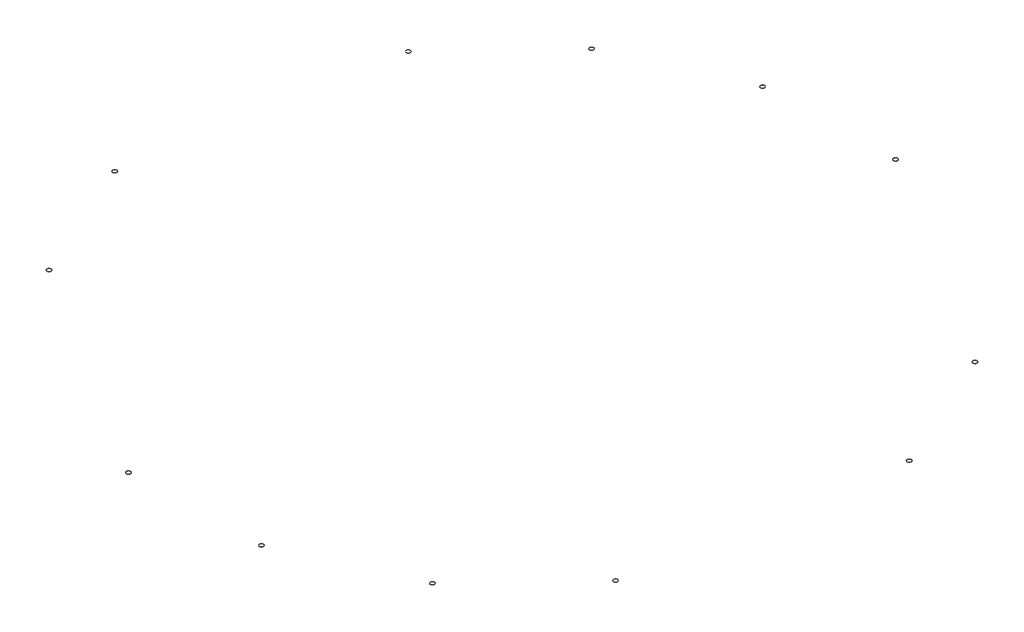
ISO-10303-21;
HEADER;
FILE_DESCRIPTION(('STEP AP214'),'2;1');
FILE_NAME('part.step','',(''),(''),'','','');
FILE_SCHEMA(('AUTOMOTIVE_DESIGN { 1 0 10303 214 1 1 1 1 }'));
ENDSEC;
DATA;
#1=APPLICATION_CONTEXT('core data for automotive mechanical design processes');
#2=APPLICATION_PROTOCOL_DEFINITION('international standard','automotive_design',2000,#1);
#3=PRODUCT_CONTEXT('',#1,'mechanical');
#4=PRODUCT('Part','Part','',(#3));
#5=PRODUCT_RELATED_PRODUCT_CATEGORY('part','',(#4));
#6=PRODUCT_DEFINITION_FORMATION('','',#4);
#7=PRODUCT_DEFINITION_CONTEXT('part definition',#1,'design');
#8=PRODUCT_DEFINITION('design','',#6,#7);
#9=PRODUCT_DEFINITION_SHAPE('','',#8);
#10=(LENGTH_UNIT() NAMED_UNIT(*) SI_UNIT(.MILLI.,.METRE.));
#11=(NAMED_UNIT(*) PLANE_ANGLE_UNIT() SI_UNIT($,.RADIAN.));
#12=(NAMED_UNIT(*) SI_UNIT($,.STERADIAN.) SOLID_ANGLE_UNIT());
#13=UNCERTAINTY_MEASURE_WITH_UNIT(LENGTH_MEASURE(1.E-05),#10,'distance_accuracy_value','');
#14=(GEOMETRIC_REPRESENTATION_CONTEXT(3) GLOBAL_UNCERTAINTY_ASSIGNED_CONTEXT((#13)) GLOBAL_UNIT_ASSIGNED_CONTEXT((#10,
#11,#12)) REPRESENTATION_CONTEXT('',''));
#15=CARTESIAN_POINT('',(0.,0.,0.));
#16=DIRECTION('',(0.,0.,1.));
#17=DIRECTION('',(1.,0.,0.));
#18=AXIS2_PLACEMENT_3D('',#15,#16,#17);
#19=CARTESIAN_POINT('',(-3286.66746070596,3.175,-2073.73273175129));
#20=DIRECTION('',(0.,1.,0.));
#21=DIRECTION('',(0.,0.,1.));
#22=AXIS2_PLACEMENT_3D('',#19,#20,#21);
#23=PLANE('',#22);
#24=CARTESIAN_POINT('',(-3286.66746070596,3.175,-2073.73273175129));
#25=DIRECTION('',(0.,1.,0.));
#26=DIRECTION('',(0.,0.,1.));
#27=AXIS2_PLACEMENT_3D('',#24,#25,#26);
#28=CIRCLE('',#27,25.3999999999998);
#29=CARTESIAN_POINT('',(-3286.66746070596,3.175,-2048.33273175129));
#30=VERTEX_POINT('',#29);
#31=EDGE_CURVE('E11',#30,#30,#28,.T.);
#32=ORIENTED_EDGE('',*,*,#31,.T.);
#33=EDGE_LOOP('',(#32));
#34=FACE_BOUND('',#33,.T.);
#35=CARTESIAN_POINT('',(-3286.66746070596,3.175,-2073.73273175129));
#36=DIRECTION('',(0.,1.,0.));
#37=DIRECTION('',(0.,0.,1.));
#38=AXIS2_PLACEMENT_3D('',#35,#36,#37);
#39=CIRCLE('',#38,22.2250000000001);
#40=CARTESIAN_POINT('',(-3286.66746070596,3.175,-2051.50773175129));
#41=VERTEX_POINT('',#40);
#42=EDGE_CURVE('E50',#41,#41,#39,.T.);
#43=ORIENTED_EDGE('',*,*,#42,.F.);
#44=EDGE_LOOP('',(#43));
#45=FACE_BOUND('',#44,.T.);
#46=ADVANCED_FACE('F39',(#34,#45),#23,.T.);
#47=CARTESIAN_POINT('',(-3286.66746070596,0.,-2073.73273175129));
#48=DIRECTION('',(0.,1.,0.));
#49=DIRECTION('',(0.,0.,1.));
#50=AXIS2_PLACEMENT_3D('',#47,#48,#49);
#51=PLANE('',#50);
#52=CARTESIAN_POINT('',(-3286.66746070596,0.,-2073.73273175129));
#53=DIRECTION('',(0.,1.,0.));
#54=DIRECTION('',(0.,0.,1.));
#55=AXIS2_PLACEMENT_3D('',#52,#53,#54);
#56=CIRCLE('',#55,25.3999999999998);
#57=CARTESIAN_POINT('',(-3286.66746070596,0.,-2048.33273175129));
#58=VERTEX_POINT('',#57);
#59=EDGE_CURVE('E43',#58,#58,#56,.T.);
#60=ORIENTED_EDGE('',*,*,#59,.F.);
#61=EDGE_LOOP('',(#60));
#62=FACE_BOUND('',#61,.T.);
#63=CARTESIAN_POINT('',(-3286.66746070596,0.,-2073.73273175129));
#64=DIRECTION('',(0.,1.,0.));
#65=DIRECTION('',(0.,0.,1.));
#66=AXIS2_PLACEMENT_3D('',#63,#64,#65);
#67=CIRCLE('',#66,22.2250000000001);
#68=CARTESIAN_POINT('',(-3286.66746070596,0.,-2051.50773175129));
#69=VERTEX_POINT('',#68);
#70=EDGE_CURVE('E52',#69,#69,#67,.T.);
#71=ORIENTED_EDGE('',*,*,#70,.T.);
#72=EDGE_LOOP('',(#71));
#73=FACE_BOUND('',#72,.T.);
#74=ADVANCED_FACE('F62',(#62,#73),#51,.F.);
#75=CARTESIAN_POINT('',(-3286.66746070596,3.175,-2073.73273175129));
#76=DIRECTION('',(0.,-1.,0.));
#77=DIRECTION('',(0.,0.,-1.));
#78=AXIS2_PLACEMENT_3D('',#75,#76,#77);
#79=CYLINDRICAL_SURFACE('',#78,25.3999999999998);
#80=ORIENTED_EDGE('',*,*,#31,.F.);
#81=EDGE_LOOP('',(#80));
#82=FACE_BOUND('',#81,.T.);
#83=ORIENTED_EDGE('',*,*,#59,.T.);
#84=EDGE_LOOP('',(#83));
#85=FACE_BOUND('',#84,.T.);
#86=ADVANCED_FACE('F41',(#82,#85),#79,.T.);
#87=CARTESIAN_POINT('',(-3286.66746070596,3.175,-2073.73273175129));
#88=DIRECTION('',(0.,-1.,0.));
#89=DIRECTION('',(0.,0.,-1.));
#90=AXIS2_PLACEMENT_3D('',#87,#88,#89);
#91=CYLINDRICAL_SURFACE('',#90,22.2250000000001);
#92=ORIENTED_EDGE('',*,*,#42,.T.);
#93=EDGE_LOOP('',(#92));
#94=FACE_BOUND('',#93,.T.);
#95=ORIENTED_EDGE('',*,*,#70,.F.);
#96=EDGE_LOOP('',(#95));
#97=FACE_BOUND('',#96,.T.);
#98=ADVANCED_FACE('F58',(#94,#97),#91,.F.);
#99=CLOSED_SHELL('',(#46,#74,#86,#98));
#100=MANIFOLD_SOLID_BREP('B2',#99);
#101=CARTESIAN_POINT('',(-2242.90163752268,3.175,-3173.63241166933));
#102=DIRECTION('',(0.,1.,0.));
#103=DIRECTION('',(0.,0.,1.));
#104=AXIS2_PLACEMENT_3D('',#101,#102,#103);
#105=PLANE('',#104);
#106=CARTESIAN_POINT('',(-2242.90163752268,3.175,-3173.63241166933));
#107=DIRECTION('',(0.,1.,0.));
#108=DIRECTION('',(0.,0.,1.));
#109=AXIS2_PLACEMENT_3D('',#106,#107,#108);
#110=CIRCLE('',#109,25.3999999999998);
#111=CARTESIAN_POINT('',(-2242.90163752268,3.175,-3148.23241166933));
#112=VERTEX_POINT('',#111);
#113=EDGE_CURVE('E38',#112,#112,#110,.T.);
#114=ORIENTED_EDGE('',*,*,#113,.T.);
#115=EDGE_LOOP('',(#114));
#116=FACE_BOUND('',#115,.T.);
#117=CARTESIAN_POINT('',(-2242.90163752268,3.175,-3173.63241166933));
#118=DIRECTION('',(0.,1.,0.));
#119=DIRECTION('',(0.,0.,1.));
#120=AXIS2_PLACEMENT_3D('',#117,#118,#119);
#121=CIRCLE('',#120,22.2250000000001);
#122=CARTESIAN_POINT('',(-2242.90163752268,3.175,-3151.40741166933));
#123=VERTEX_POINT('',#122);
#124=EDGE_CURVE('E119',#123,#123,#121,.T.);
#125=ORIENTED_EDGE('',*,*,#124,.F.);
#126=EDGE_LOOP('',(#125));
#127=FACE_BOUND('',#126,.T.);
#128=ADVANCED_FACE('F108',(#116,#127),#105,.T.);
#129=CARTESIAN_POINT('',(-2242.90163752268,0.,-3173.63241166933));
#130=DIRECTION('',(0.,1.,0.));
#131=DIRECTION('',(0.,0.,1.));
#132=AXIS2_PLACEMENT_3D('',#129,#130,#131);
#133=PLANE('',#132);
#134=CARTESIAN_POINT('',(-2242.90163752268,0.,-3173.63241166933));
#135=DIRECTION('',(0.,1.,0.));
#136=DIRECTION('',(0.,0.,1.));
#137=AXIS2_PLACEMENT_3D('',#134,#135,#136);
#138=CIRCLE('',#137,25.3999999999998);
#139=CARTESIAN_POINT('',(-2242.90163752268,0.,-3148.23241166933));
#140=VERTEX_POINT('',#139);
#141=EDGE_CURVE('E112',#140,#140,#138,.T.);
#142=ORIENTED_EDGE('',*,*,#141,.F.);
#143=EDGE_LOOP('',(#142));
#144=FACE_BOUND('',#143,.T.);
#145=CARTESIAN_POINT('',(-2242.90163752268,0.,-3173.63241166933));
#146=DIRECTION('',(0.,1.,0.));
#147=DIRECTION('',(0.,0.,1.));
#148=AXIS2_PLACEMENT_3D('',#145,#146,#147);
#149=CIRCLE('',#148,22.2250000000001);
#150=CARTESIAN_POINT('',(-2242.90163752268,0.,-3151.40741166933));
#151=VERTEX_POINT('',#150);
#152=EDGE_CURVE('E121',#151,#151,#149,.T.);
#153=ORIENTED_EDGE('',*,*,#152,.T.);
#154=EDGE_LOOP('',(#153));
#155=FACE_BOUND('',#154,.T.);
#156=ADVANCED_FACE('F131',(#144,#155),#133,.F.);
#157=CARTESIAN_POINT('',(-2242.90163752268,3.175,-3173.63241166933));
#158=DIRECTION('',(0.,-1.,0.));
#159=DIRECTION('',(0.,0.,-1.));
#160=AXIS2_PLACEMENT_3D('',#157,#158,#159);
#161=CYLINDRICAL_SURFACE('',#160,25.3999999999998);
#162=ORIENTED_EDGE('',*,*,#113,.F.);
#163=EDGE_LOOP('',(#162));
#164=FACE_BOUND('',#163,.T.);
#165=ORIENTED_EDGE('',*,*,#141,.T.);
#166=EDGE_LOOP('',(#165));
#167=FACE_BOUND('',#166,.T.);
#168=ADVANCED_FACE('F110',(#164,#167),#161,.T.);
#169=CARTESIAN_POINT('',(-2242.90163752268,3.175,-3173.63241166933));
#170=DIRECTION('',(0.,-1.,0.));
#171=DIRECTION('',(0.,0.,-1.));
#172=AXIS2_PLACEMENT_3D('',#169,#170,#171);
#173=CYLINDRICAL_SURFACE('',#172,22.2250000000001);
#174=ORIENTED_EDGE('',*,*,#124,.T.);
#175=EDGE_LOOP('',(#174));
#176=FACE_BOUND('',#175,.T.);
#177=ORIENTED_EDGE('',*,*,#152,.F.);
#178=EDGE_LOOP('',(#177));
#179=FACE_BOUND('',#178,.T.);
#180=ADVANCED_FACE('F127',(#176,#179),#173,.F.);
#181=CLOSED_SHELL('',(#128,#156,#168,#180));
#182=MANIFOLD_SOLID_BREP('B6',#181);
#183=CARTESIAN_POINT('',(-857.674371980562,3.175,-3790.37532596018));
#184=DIRECTION('',(0.,1.,0.));
#185=DIRECTION('',(0.,0.,1.));
#186=AXIS2_PLACEMENT_3D('',#183,#184,#185);
#187=PLANE('',#186);
#188=CARTESIAN_POINT('',(-857.674371980562,3.175,-3790.37532596018));
#189=DIRECTION('',(0.,1.,0.));
#190=DIRECTION('',(0.,0.,1.));
#191=AXIS2_PLACEMENT_3D('',#188,#189,#190);
#192=CIRCLE('',#191,25.4);
#193=CARTESIAN_POINT('',(-857.674371980562,3.175,-3764.97532596018));
#194=VERTEX_POINT('',#193);
#195=EDGE_CURVE('E107',#194,#194,#192,.T.);
#196=ORIENTED_EDGE('',*,*,#195,.T.);
#197=EDGE_LOOP('',(#196));
#198=FACE_BOUND('',#197,.T.);
#199=CARTESIAN_POINT('',(-857.674371980562,3.175,-3790.37532596018));
#200=DIRECTION('',(0.,1.,0.));
#201=DIRECTION('',(0.,0.,1.));
#202=AXIS2_PLACEMENT_3D('',#199,#200,#201);
#203=CIRCLE('',#202,22.225);
#204=CARTESIAN_POINT('',(-857.674371980562,3.175,-3768.15032596018));
#205=VERTEX_POINT('',#204);
#206=EDGE_CURVE('E188',#205,#205,#203,.T.);
#207=ORIENTED_EDGE('',*,*,#206,.F.);
#208=EDGE_LOOP('',(#207));
#209=FACE_BOUND('',#208,.T.);
#210=ADVANCED_FACE('F177',(#198,#209),#187,.T.);
#211=CARTESIAN_POINT('',(-857.674371980562,0.,-3790.37532596018));
#212=DIRECTION('',(0.,1.,0.));
#213=DIRECTION('',(0.,0.,1.));
#214=AXIS2_PLACEMENT_3D('',#211,#212,#213);
#215=PLANE('',#214);
#216=CARTESIAN_POINT('',(-857.674371980562,0.,-3790.37532596018));
#217=DIRECTION('',(0.,1.,0.));
#218=DIRECTION('',(0.,0.,1.));
#219=AXIS2_PLACEMENT_3D('',#216,#217,#218);
#220=CIRCLE('',#219,25.4);
#221=CARTESIAN_POINT('',(-857.674371980562,0.,-3764.97532596018));
#222=VERTEX_POINT('',#221);
#223=EDGE_CURVE('E181',#222,#222,#220,.T.);
#224=ORIENTED_EDGE('',*,*,#223,.F.);
#225=EDGE_LOOP('',(#224));
#226=FACE_BOUND('',#225,.T.);
#227=CARTESIAN_POINT('',(-857.674371980562,0.,-3790.37532596018));
#228=DIRECTION('',(0.,1.,0.));
#229=DIRECTION('',(0.,0.,1.));
#230=AXIS2_PLACEMENT_3D('',#227,#228,#229);
#231=CIRCLE('',#230,22.225);
#232=CARTESIAN_POINT('',(-857.674371980562,0.,-3768.15032596018));
#233=VERTEX_POINT('',#232);
#234=EDGE_CURVE('E190',#233,#233,#231,.T.);
#235=ORIENTED_EDGE('',*,*,#234,.T.);
#236=EDGE_LOOP('',(#235));
#237=FACE_BOUND('',#236,.T.);
#238=ADVANCED_FACE('F200',(#226,#237),#215,.F.);
#239=CARTESIAN_POINT('',(-857.674371980562,3.175,-3790.37532596018));
#240=DIRECTION('',(0.,-1.,0.));
#241=DIRECTION('',(0.,0.,-1.));
#242=AXIS2_PLACEMENT_3D('',#239,#240,#241);
#243=CYLINDRICAL_SURFACE('',#242,25.4);
#244=ORIENTED_EDGE('',*,*,#195,.F.);
#245=EDGE_LOOP('',(#244));
#246=FACE_BOUND('',#245,.T.);
#247=ORIENTED_EDGE('',*,*,#223,.T.);
#248=EDGE_LOOP('',(#247));
#249=FACE_BOUND('',#248,.T.);
#250=ADVANCED_FACE('F179',(#246,#249),#243,.T.);
#251=CARTESIAN_POINT('',(-857.674371980562,3.175,-3790.37532596018));
#252=DIRECTION('',(0.,-1.,0.));
#253=DIRECTION('',(0.,0.,-1.));
#254=AXIS2_PLACEMENT_3D('',#251,#252,#253);
#255=CYLINDRICAL_SURFACE('',#254,22.225);
#256=ORIENTED_EDGE('',*,*,#206,.T.);
#257=EDGE_LOOP('',(#256));
#258=FACE_BOUND('',#257,.T.);
#259=ORIENTED_EDGE('',*,*,#234,.F.);
#260=EDGE_LOOP('',(#259));
#261=FACE_BOUND('',#260,.T.);
#262=ADVANCED_FACE('F196',(#258,#261),#255,.F.);
#263=CLOSED_SHELL('',(#210,#238,#250,#262));
#264=MANIFOLD_SOLID_BREP('B33',#263);
#265=CARTESIAN_POINT('',(658.126041858051,3.175,-3830.06795671151));
#266=DIRECTION('',(0.,1.,0.));
#267=DIRECTION('',(0.,0.,1.));
#268=AXIS2_PLACEMENT_3D('',#265,#266,#267);
#269=PLANE('',#268);
#270=CARTESIAN_POINT('',(658.126041858051,3.175,-3830.06795671151));
#271=DIRECTION('',(0.,1.,0.));
#272=DIRECTION('',(0.,0.,1.));
#273=AXIS2_PLACEMENT_3D('',#270,#271,#272);
#274=CIRCLE('',#273,25.4);
#275=CARTESIAN_POINT('',(658.126041858051,3.175,-3804.66795671151));
#276=VERTEX_POINT('',#275);
#277=EDGE_CURVE('E176',#276,#276,#274,.T.);
#278=ORIENTED_EDGE('',*,*,#277,.T.);
#279=EDGE_LOOP('',(#278));
#280=FACE_BOUND('',#279,.T.);
#281=CARTESIAN_POINT('',(658.126041858051,3.175,-3830.06795671151));
#282=DIRECTION('',(0.,1.,0.));
#283=DIRECTION('',(0.,0.,1.));
#284=AXIS2_PLACEMENT_3D('',#281,#282,#283);
#285=CIRCLE('',#284,22.225);
#286=CARTESIAN_POINT('',(658.126041858051,3.175,-3807.84295671151));
#287=VERTEX_POINT('',#286);
#288=EDGE_CURVE('E257',#287,#287,#285,.T.);
#289=ORIENTED_EDGE('',*,*,#288,.F.);
#290=EDGE_LOOP('',(#289));
#291=FACE_BOUND('',#290,.T.);
#292=ADVANCED_FACE('F246',(#280,#291),#269,.T.);
#293=CARTESIAN_POINT('',(658.126041858051,0.,-3830.06795671151));
#294=DIRECTION('',(0.,1.,0.));
#295=DIRECTION('',(0.,0.,1.));
#296=AXIS2_PLACEMENT_3D('',#293,#294,#295);
#297=PLANE('',#296);
#298=CARTESIAN_POINT('',(658.126041858051,0.,-3830.06795671151));
#299=DIRECTION('',(0.,1.,0.));
#300=DIRECTION('',(0.,0.,1.));
#301=AXIS2_PLACEMENT_3D('',#298,#299,#300);
#302=CIRCLE('',#301,25.4);
#303=CARTESIAN_POINT('',(658.126041858051,0.,-3804.66795671151));
#304=VERTEX_POINT('',#303);
#305=EDGE_CURVE('E250',#304,#304,#302,.T.);
#306=ORIENTED_EDGE('',*,*,#305,.F.);
#307=EDGE_LOOP('',(#306));
#308=FACE_BOUND('',#307,.T.);
#309=CARTESIAN_POINT('',(658.126041858051,0.,-3830.06795671151));
#310=DIRECTION('',(0.,1.,0.));
#311=DIRECTION('',(0.,0.,1.));
#312=AXIS2_PLACEMENT_3D('',#309,#310,#311);
#313=CIRCLE('',#312,22.225);
#314=CARTESIAN_POINT('',(658.126041858051,0.,-3807.84295671151));
#315=VERTEX_POINT('',#314);
#316=EDGE_CURVE('E259',#315,#315,#313,.T.);
#317=ORIENTED_EDGE('',*,*,#316,.T.);
#318=EDGE_LOOP('',(#317));
#319=FACE_BOUND('',#318,.T.);
#320=ADVANCED_FACE('F269',(#308,#319),#297,.F.);
#321=CARTESIAN_POINT('',(658.126041858051,3.175,-3830.06795671151));
#322=DIRECTION('',(0.,-1.,0.));
#323=DIRECTION('',(0.,0.,-1.));
#324=AXIS2_PLACEMENT_3D('',#321,#322,#323);
#325=CYLINDRICAL_SURFACE('',#324,25.4);
#326=ORIENTED_EDGE('',*,*,#277,.F.);
#327=EDGE_LOOP('',(#326));
#328=FACE_BOUND('',#327,.T.);
#329=ORIENTED_EDGE('',*,*,#305,.T.);
#330=EDGE_LOOP('',(#329));
#331=FACE_BOUND('',#330,.T.);
#332=ADVANCED_FACE('F248',(#328,#331),#325,.T.);
#333=CARTESIAN_POINT('',(658.126041858051,3.175,-3830.06795671151));
#334=DIRECTION('',(0.,-1.,0.));
#335=DIRECTION('',(0.,0.,-1.));
#336=AXIS2_PLACEMENT_3D('',#333,#334,#335);
#337=CYLINDRICAL_SURFACE('',#336,22.225);
#338=ORIENTED_EDGE('',*,*,#288,.T.);
#339=EDGE_LOOP('',(#338));
#340=FACE_BOUND('',#339,.T.);
#341=ORIENTED_EDGE('',*,*,#316,.F.);
#342=EDGE_LOOP('',(#341));
#343=FACE_BOUND('',#342,.T.);
#344=ADVANCED_FACE('F265',(#340,#343),#337,.F.);
#345=CLOSED_SHELL('',(#292,#320,#332,#344));
#346=MANIFOLD_SOLID_BREP('B102',#345);
#347=CARTESIAN_POINT('',(3173.63241166929,3.175,-2242.90163752274));
#348=DIRECTION('',(0.,1.,0.));
#349=DIRECTION('',(0.,0.,1.));
#350=AXIS2_PLACEMENT_3D('',#347,#348,#349);
#351=PLANE('',#350);
#352=CARTESIAN_POINT('',(3173.63241166929,3.175,-2242.90163752274));
#353=DIRECTION('',(0.,1.,0.));
#354=DIRECTION('',(0.,0.,1.));
#355=AXIS2_PLACEMENT_3D('',#352,#353,#354);
#356=CIRCLE('',#355,25.3999999999998);
#357=CARTESIAN_POINT('',(3173.63241166929,3.175,-2217.50163752274));
#358=VERTEX_POINT('',#357);
#359=EDGE_CURVE('E245',#358,#358,#356,.T.);
#360=ORIENTED_EDGE('',*,*,#359,.T.);
#361=EDGE_LOOP('',(#360));
#362=FACE_BOUND('',#361,.T.);
#363=CARTESIAN_POINT('',(3173.63241166929,3.175,-2242.90163752274));
#364=DIRECTION('',(0.,1.,0.));
#365=DIRECTION('',(0.,0.,1.));
#366=AXIS2_PLACEMENT_3D('',#363,#364,#365);
#367=CIRCLE('',#366,22.2250000000001);
#368=CARTESIAN_POINT('',(3173.63241166929,3.175,-2220.67663752274));
#369=VERTEX_POINT('',#368);
#370=EDGE_CURVE('E326',#369,#369,#367,.T.);
#371=ORIENTED_EDGE('',*,*,#370,.F.);
#372=EDGE_LOOP('',(#371));
#373=FACE_BOUND('',#372,.T.);
#374=ADVANCED_FACE('F315',(#362,#373),#351,.T.);
#375=CARTESIAN_POINT('',(3173.63241166929,0.,-2242.90163752274));
#376=DIRECTION('',(0.,1.,0.));
#377=DIRECTION('',(0.,0.,1.));
#378=AXIS2_PLACEMENT_3D('',#375,#376,#377);
#379=PLANE('',#378);
#380=CARTESIAN_POINT('',(3173.63241166929,0.,-2242.90163752274));
#381=DIRECTION('',(0.,1.,0.));
#382=DIRECTION('',(0.,0.,1.));
#383=AXIS2_PLACEMENT_3D('',#380,#381,#382);
#384=CIRCLE('',#383,25.3999999999998);
#385=CARTESIAN_POINT('',(3173.63241166929,0.,-2217.50163752274));
#386=VERTEX_POINT('',#385);
#387=EDGE_CURVE('E319',#386,#386,#384,.T.);
#388=ORIENTED_EDGE('',*,*,#387,.F.);
#389=EDGE_LOOP('',(#388));
#390=FACE_BOUND('',#389,.T.);
#391=CARTESIAN_POINT('',(3173.63241166929,0.,-2242.90163752274));
#392=DIRECTION('',(0.,1.,0.));
#393=DIRECTION('',(0.,0.,1.));
#394=AXIS2_PLACEMENT_3D('',#391,#392,#393);
#395=CIRCLE('',#394,22.2250000000001);
#396=CARTESIAN_POINT('',(3173.63241166929,0.,-2220.67663752274));
#397=VERTEX_POINT('',#396);
#398=EDGE_CURVE('E328',#397,#397,#395,.T.);
#399=ORIENTED_EDGE('',*,*,#398,.T.);
#400=EDGE_LOOP('',(#399));
#401=FACE_BOUND('',#400,.T.);
#402=ADVANCED_FACE('F338',(#390,#401),#379,.F.);
#403=CARTESIAN_POINT('',(3173.63241166929,3.175,-2242.90163752274));
#404=DIRECTION('',(0.,-1.,0.));
#405=DIRECTION('',(0.,0.,-1.));
#406=AXIS2_PLACEMENT_3D('',#403,#404,#405);
#407=CYLINDRICAL_SURFACE('',#406,25.3999999999998);
#408=ORIENTED_EDGE('',*,*,#359,.F.);
#409=EDGE_LOOP('',(#408));
#410=FACE_BOUND('',#409,.T.);
#411=ORIENTED_EDGE('',*,*,#387,.T.);
#412=EDGE_LOOP('',(#411));
#413=FACE_BOUND('',#412,.T.);
#414=ADVANCED_FACE('F317',(#410,#413),#407,.T.);
#415=CARTESIAN_POINT('',(3173.63241166929,3.175,-2242.90163752274));
#416=DIRECTION('',(0.,-1.,0.));
#417=DIRECTION('',(0.,0.,-1.));
#418=AXIS2_PLACEMENT_3D('',#415,#416,#417);
#419=CYLINDRICAL_SURFACE('',#418,22.2250000000001);
#420=ORIENTED_EDGE('',*,*,#370,.T.);
#421=EDGE_LOOP('',(#420));
#422=FACE_BOUND('',#421,.T.);
#423=ORIENTED_EDGE('',*,*,#398,.F.);
#424=EDGE_LOOP('',(#423));
#425=FACE_BOUND('',#424,.T.);
#426=ADVANCED_FACE('F334',(#422,#425),#419,.F.);
#427=CLOSED_SHELL('',(#374,#402,#414,#426));
#428=MANIFOLD_SOLID_BREP('B171',#427);
#429=CARTESIAN_POINT('',(3790.37532596017,3.175,-857.674371980631));
#430=DIRECTION('',(0.,1.,0.));
#431=DIRECTION('',(0.,0.,1.));
#432=AXIS2_PLACEMENT_3D('',#429,#430,#431);
#433=PLANE('',#432);
#434=CARTESIAN_POINT('',(3790.37532596017,3.175,-857.674371980631));
#435=DIRECTION('',(0.,1.,0.));
#436=DIRECTION('',(0.,0.,1.));
#437=AXIS2_PLACEMENT_3D('',#434,#435,#436);
#438=CIRCLE('',#437,25.3999999999998);
#439=CARTESIAN_POINT('',(3790.37532596017,3.175,-832.274371980631));
#440=VERTEX_POINT('',#439);
#441=EDGE_CURVE('E314',#440,#440,#438,.T.);
#442=ORIENTED_EDGE('',*,*,#441,.T.);
#443=EDGE_LOOP('',(#442));
#444=FACE_BOUND('',#443,.T.);
#445=CARTESIAN_POINT('',(3790.37532596017,3.175,-857.674371980631));
#446=DIRECTION('',(0.,1.,0.));
#447=DIRECTION('',(0.,0.,1.));
#448=AXIS2_PLACEMENT_3D('',#445,#446,#447);
#449=CIRCLE('',#448,22.2250000000001);
#450=CARTESIAN_POINT('',(3790.37532596017,3.175,-835.449371980631));
#451=VERTEX_POINT('',#450);
#452=EDGE_CURVE('E395',#451,#451,#449,.T.);
#453=ORIENTED_EDGE('',*,*,#452,.F.);
#454=EDGE_LOOP('',(#453));
#455=FACE_BOUND('',#454,.T.);
#456=ADVANCED_FACE('F384',(#444,#455),#433,.T.);
#457=CARTESIAN_POINT('',(3790.37532596017,0.,-857.674371980631));
#458=DIRECTION('',(0.,1.,0.));
#459=DIRECTION('',(0.,0.,1.));
#460=AXIS2_PLACEMENT_3D('',#457,#458,#459);
#461=PLANE('',#460);
#462=CARTESIAN_POINT('',(3790.37532596017,0.,-857.674371980631));
#463=DIRECTION('',(0.,1.,0.));
#464=DIRECTION('',(0.,0.,1.));
#465=AXIS2_PLACEMENT_3D('',#462,#463,#464);
#466=CIRCLE('',#465,25.3999999999998);
#467=CARTESIAN_POINT('',(3790.37532596017,0.,-832.274371980631));
#468=VERTEX_POINT('',#467);
#469=EDGE_CURVE('E388',#468,#468,#466,.T.);
#470=ORIENTED_EDGE('',*,*,#469,.F.);
#471=EDGE_LOOP('',(#470));
#472=FACE_BOUND('',#471,.T.);
#473=CARTESIAN_POINT('',(3790.37532596017,0.,-857.674371980631));
#474=DIRECTION('',(0.,1.,0.));
#475=DIRECTION('',(0.,0.,1.));
#476=AXIS2_PLACEMENT_3D('',#473,#474,#475);
#477=CIRCLE('',#476,22.2250000000001);
#478=CARTESIAN_POINT('',(3790.37532596017,0.,-835.449371980631));
#479=VERTEX_POINT('',#478);
#480=EDGE_CURVE('E397',#479,#479,#477,.T.);
#481=ORIENTED_EDGE('',*,*,#480,.T.);
#482=EDGE_LOOP('',(#481));
#483=FACE_BOUND('',#482,.T.);
#484=ADVANCED_FACE('F407',(#472,#483),#461,.F.);
#485=CARTESIAN_POINT('',(3790.37532596017,3.175,-857.674371980631));
#486=DIRECTION('',(0.,-1.,0.));
#487=DIRECTION('',(0.,0.,-1.));
#488=AXIS2_PLACEMENT_3D('',#485,#486,#487);
#489=CYLINDRICAL_SURFACE('',#488,25.3999999999998);
#490=ORIENTED_EDGE('',*,*,#441,.F.);
#491=EDGE_LOOP('',(#490));
#492=FACE_BOUND('',#491,.T.);
#493=ORIENTED_EDGE('',*,*,#469,.T.);
#494=EDGE_LOOP('',(#493));
#495=FACE_BOUND('',#494,.T.);
#496=ADVANCED_FACE('F386',(#492,#495),#489,.T.);
#497=CARTESIAN_POINT('',(3790.37532596017,3.175,-857.674371980631));
#498=DIRECTION('',(0.,-1.,0.));
#499=DIRECTION('',(0.,0.,-1.));
#500=AXIS2_PLACEMENT_3D('',#497,#498,#499);
#501=CYLINDRICAL_SURFACE('',#500,22.2250000000001);
#502=ORIENTED_EDGE('',*,*,#452,.T.);
#503=EDGE_LOOP('',(#502));
#504=FACE_BOUND('',#503,.T.);
#505=ORIENTED_EDGE('',*,*,#480,.F.);
#506=EDGE_LOOP('',(#505));
#507=FACE_BOUND('',#506,.T.);
#508=ADVANCED_FACE('F403',(#504,#507),#501,.F.);
#509=CLOSED_SHELL('',(#456,#484,#496,#508));
#510=MANIFOLD_SOLID_BREP('B240',#509);
#511=CARTESIAN_POINT('',(3286.66746070594,3.175,2073.73273175131));
#512=DIRECTION('',(0.,1.,0.));
#513=DIRECTION('',(0.,0.,1.));
#514=AXIS2_PLACEMENT_3D('',#511,#512,#513);
#515=PLANE('',#514);
#516=CARTESIAN_POINT('',(3286.66746070594,3.175,2073.73273175131));
#517=DIRECTION('',(0.,1.,0.));
#518=DIRECTION('',(0.,0.,1.));
#519=AXIS2_PLACEMENT_3D('',#516,#517,#518);
#520=CIRCLE('',#519,25.3999999999998);
#521=CARTESIAN_POINT('',(3286.66746070594,3.175,2099.13273175131));
#522=VERTEX_POINT('',#521);
#523=EDGE_CURVE('E383',#522,#522,#520,.T.);
#524=ORIENTED_EDGE('',*,*,#523,.T.);
#525=EDGE_LOOP('',(#524));
#526=FACE_BOUND('',#525,.T.);
#527=CARTESIAN_POINT('',(3286.66746070594,3.175,2073.73273175131));
#528=DIRECTION('',(0.,1.,0.));
#529=DIRECTION('',(0.,0.,1.));
#530=AXIS2_PLACEMENT_3D('',#527,#528,#529);
#531=CIRCLE('',#530,22.2250000000001);
#532=CARTESIAN_POINT('',(3286.66746070594,3.175,2095.95773175131));
#533=VERTEX_POINT('',#532);
#534=EDGE_CURVE('E464',#533,#533,#531,.T.);
#535=ORIENTED_EDGE('',*,*,#534,.F.);
#536=EDGE_LOOP('',(#535));
#537=FACE_BOUND('',#536,.T.);
#538=ADVANCED_FACE('F453',(#526,#537),#515,.T.);
#539=CARTESIAN_POINT('',(3286.66746070594,0.,2073.73273175131));
#540=DIRECTION('',(0.,1.,0.));
#541=DIRECTION('',(0.,0.,1.));
#542=AXIS2_PLACEMENT_3D('',#539,#540,#541);
#543=PLANE('',#542);
#544=CARTESIAN_POINT('',(3286.66746070594,0.,2073.73273175131));
#545=DIRECTION('',(0.,1.,0.));
#546=DIRECTION('',(0.,0.,1.));
#547=AXIS2_PLACEMENT_3D('',#544,#545,#546);
#548=CIRCLE('',#547,25.3999999999998);
#549=CARTESIAN_POINT('',(3286.66746070594,0.,2099.13273175131));
#550=VERTEX_POINT('',#549);
#551=EDGE_CURVE('E457',#550,#550,#548,.T.);
#552=ORIENTED_EDGE('',*,*,#551,.F.);
#553=EDGE_LOOP('',(#552));
#554=FACE_BOUND('',#553,.T.);
#555=CARTESIAN_POINT('',(3286.66746070594,0.,2073.73273175131));
#556=DIRECTION('',(0.,1.,0.));
#557=DIRECTION('',(0.,0.,1.));
#558=AXIS2_PLACEMENT_3D('',#555,#556,#557);
#559=CIRCLE('',#558,22.2250000000001);
#560=CARTESIAN_POINT('',(3286.66746070594,0.,2095.95773175131));
#561=VERTEX_POINT('',#560);
#562=EDGE_CURVE('E466',#561,#561,#559,.T.);
#563=ORIENTED_EDGE('',*,*,#562,.T.);
#564=EDGE_LOOP('',(#563));
#565=FACE_BOUND('',#564,.T.);
#566=ADVANCED_FACE('F476',(#554,#565),#543,.F.);
#567=CARTESIAN_POINT('',(3286.66746070594,3.175,2073.73273175131));
#568=DIRECTION('',(0.,-1.,0.));
#569=DIRECTION('',(0.,0.,-1.));
#570=AXIS2_PLACEMENT_3D('',#567,#568,#569);
#571=CYLINDRICAL_SURFACE('',#570,25.3999999999998);
#572=ORIENTED_EDGE('',*,*,#523,.F.);
#573=EDGE_LOOP('',(#572));
#574=FACE_BOUND('',#573,.T.);
#575=ORIENTED_EDGE('',*,*,#551,.T.);
#576=EDGE_LOOP('',(#575));
#577=FACE_BOUND('',#576,.T.);
#578=ADVANCED_FACE('F455',(#574,#577),#571,.T.);
#579=CARTESIAN_POINT('',(3286.66746070594,3.175,2073.73273175131));
#580=DIRECTION('',(0.,-1.,0.));
#581=DIRECTION('',(0.,0.,-1.));
#582=AXIS2_PLACEMENT_3D('',#579,#580,#581);
#583=CYLINDRICAL_SURFACE('',#582,22.2250000000001);
#584=ORIENTED_EDGE('',*,*,#534,.T.);
#585=EDGE_LOOP('',(#584));
#586=FACE_BOUND('',#585,.T.);
#587=ORIENTED_EDGE('',*,*,#562,.F.);
#588=EDGE_LOOP('',(#587));
#589=FACE_BOUND('',#588,.T.);
#590=ADVANCED_FACE('F472',(#586,#589),#583,.F.);
#591=CLOSED_SHELL('',(#538,#566,#578,#590));
#592=MANIFOLD_SOLID_BREP('B309',#591);
#593=CARTESIAN_POINT('',(2242.90163752266,3.175,3173.63241166934));
#594=DIRECTION('',(0.,1.,0.));
#595=DIRECTION('',(0.,0.,1.));
#596=AXIS2_PLACEMENT_3D('',#593,#594,#595);
#597=PLANE('',#596);
#598=CARTESIAN_POINT('',(2242.90163752266,3.175,3173.63241166934));
#599=DIRECTION('',(0.,1.,0.));
#600=DIRECTION('',(0.,0.,1.));
#601=AXIS2_PLACEMENT_3D('',#598,#599,#600);
#602=CIRCLE('',#601,25.3999999999998);
#603=CARTESIAN_POINT('',(2242.90163752266,3.175,3199.03241166934));
#604=VERTEX_POINT('',#603);
#605=EDGE_CURVE('E452',#604,#604,#602,.T.);
#606=ORIENTED_EDGE('',*,*,#605,.T.);
#607=EDGE_LOOP('',(#606));
#608=FACE_BOUND('',#607,.T.);
#609=CARTESIAN_POINT('',(2242.90163752266,3.175,3173.63241166934));
#610=DIRECTION('',(0.,1.,0.));
#611=DIRECTION('',(0.,0.,1.));
#612=AXIS2_PLACEMENT_3D('',#609,#610,#611);
#613=CIRCLE('',#612,22.2250000000001);
#614=CARTESIAN_POINT('',(2242.90163752266,3.175,3195.85741166934));
#615=VERTEX_POINT('',#614);
#616=EDGE_CURVE('E533',#615,#615,#613,.T.);
#617=ORIENTED_EDGE('',*,*,#616,.F.);
#618=EDGE_LOOP('',(#617));
#619=FACE_BOUND('',#618,.T.);
#620=ADVANCED_FACE('F522',(#608,#619),#597,.T.);
#621=CARTESIAN_POINT('',(2242.90163752266,0.,3173.63241166934));
#622=DIRECTION('',(0.,1.,0.));
#623=DIRECTION('',(0.,0.,1.));
#624=AXIS2_PLACEMENT_3D('',#621,#622,#623);
#625=PLANE('',#624);
#626=CARTESIAN_POINT('',(2242.90163752266,0.,3173.63241166934));
#627=DIRECTION('',(0.,1.,0.));
#628=DIRECTION('',(0.,0.,1.));
#629=AXIS2_PLACEMENT_3D('',#626,#627,#628);
#630=CIRCLE('',#629,25.3999999999998);
#631=CARTESIAN_POINT('',(2242.90163752266,0.,3199.03241166934));
#632=VERTEX_POINT('',#631);
#633=EDGE_CURVE('E526',#632,#632,#630,.T.);
#634=ORIENTED_EDGE('',*,*,#633,.F.);
#635=EDGE_LOOP('',(#634));
#636=FACE_BOUND('',#635,.T.);
#637=CARTESIAN_POINT('',(2242.90163752266,0.,3173.63241166934));
#638=DIRECTION('',(0.,1.,0.));
#639=DIRECTION('',(0.,0.,1.));
#640=AXIS2_PLACEMENT_3D('',#637,#638,#639);
#641=CIRCLE('',#640,22.2250000000001);
#642=CARTESIAN_POINT('',(2242.90163752266,0.,3195.85741166934));
#643=VERTEX_POINT('',#642);
#644=EDGE_CURVE('E535',#643,#643,#641,.T.);
#645=ORIENTED_EDGE('',*,*,#644,.T.);
#646=EDGE_LOOP('',(#645));
#647=FACE_BOUND('',#646,.T.);
#648=ADVANCED_FACE('F545',(#636,#647),#625,.F.);
#649=CARTESIAN_POINT('',(2242.90163752266,3.175,3173.63241166934));
#650=DIRECTION('',(0.,-1.,0.));
#651=DIRECTION('',(0.,0.,-1.));
#652=AXIS2_PLACEMENT_3D('',#649,#650,#651);
#653=CYLINDRICAL_SURFACE('',#652,25.3999999999998);
#654=ORIENTED_EDGE('',*,*,#605,.F.);
#655=EDGE_LOOP('',(#654));
#656=FACE_BOUND('',#655,.T.);
#657=ORIENTED_EDGE('',*,*,#633,.T.);
#658=EDGE_LOOP('',(#657));
#659=FACE_BOUND('',#658,.T.);
#660=ADVANCED_FACE('F524',(#656,#659),#653,.T.);
#661=CARTESIAN_POINT('',(2242.90163752266,3.175,3173.63241166934));
#662=DIRECTION('',(0.,-1.,0.));
#663=DIRECTION('',(0.,0.,-1.));
#664=AXIS2_PLACEMENT_3D('',#661,#662,#663);
#665=CYLINDRICAL_SURFACE('',#664,22.2250000000001);
#666=ORIENTED_EDGE('',*,*,#616,.T.);
#667=EDGE_LOOP('',(#666));
#668=FACE_BOUND('',#667,.T.);
#669=ORIENTED_EDGE('',*,*,#644,.F.);
#670=EDGE_LOOP('',(#669));
#671=FACE_BOUND('',#670,.T.);
#672=ADVANCED_FACE('F541',(#668,#671),#665,.F.);
#673=CLOSED_SHELL('',(#620,#648,#660,#672));
#674=MANIFOLD_SOLID_BREP('B378',#673);
#675=CARTESIAN_POINT('',(857.674371980533,3.175,3790.37532596019));
#676=DIRECTION('',(0.,1.,0.));
#677=DIRECTION('',(0.,0.,1.));
#678=AXIS2_PLACEMENT_3D('',#675,#676,#677);
#679=PLANE('',#678);
#680=CARTESIAN_POINT('',(857.674371980533,3.175,3790.37532596019));
#681=DIRECTION('',(0.,1.,0.));
#682=DIRECTION('',(0.,0.,1.));
#683=AXIS2_PLACEMENT_3D('',#680,#681,#682);
#684=CIRCLE('',#683,25.4);
#685=CARTESIAN_POINT('',(857.674371980533,3.175,3815.77532596019));
#686=VERTEX_POINT('',#685);
#687=EDGE_CURVE('E521',#686,#686,#684,.T.);
#688=ORIENTED_EDGE('',*,*,#687,.T.);
#689=EDGE_LOOP('',(#688));
#690=FACE_BOUND('',#689,.T.);
#691=CARTESIAN_POINT('',(857.674371980533,3.175,3790.37532596019));
#692=DIRECTION('',(0.,1.,0.));
#693=DIRECTION('',(0.,0.,1.));
#694=AXIS2_PLACEMENT_3D('',#691,#692,#693);
#695=CIRCLE('',#694,22.225);
#696=CARTESIAN_POINT('',(857.674371980533,3.175,3812.60032596019));
#697=VERTEX_POINT('',#696);
#698=EDGE_CURVE('E602',#697,#697,#695,.T.);
#699=ORIENTED_EDGE('',*,*,#698,.F.);
#700=EDGE_LOOP('',(#699));
#701=FACE_BOUND('',#700,.T.);
#702=ADVANCED_FACE('F591',(#690,#701),#679,.T.);
#703=CARTESIAN_POINT('',(857.674371980533,0.,3790.37532596019));
#704=DIRECTION('',(0.,1.,0.));
#705=DIRECTION('',(0.,0.,1.));
#706=AXIS2_PLACEMENT_3D('',#703,#704,#705);
#707=PLANE('',#706);
#708=CARTESIAN_POINT('',(857.674371980533,0.,3790.37532596019));
#709=DIRECTION('',(0.,1.,0.));
#710=DIRECTION('',(0.,0.,1.));
#711=AXIS2_PLACEMENT_3D('',#708,#709,#710);
#712=CIRCLE('',#711,25.4);
#713=CARTESIAN_POINT('',(857.674371980533,0.,3815.77532596019));
#714=VERTEX_POINT('',#713);
#715=EDGE_CURVE('E595',#714,#714,#712,.T.);
#716=ORIENTED_EDGE('',*,*,#715,.F.);
#717=EDGE_LOOP('',(#716));
#718=FACE_BOUND('',#717,.T.);
#719=CARTESIAN_POINT('',(857.674371980533,0.,3790.37532596019));
#720=DIRECTION('',(0.,1.,0.));
#721=DIRECTION('',(0.,0.,1.));
#722=AXIS2_PLACEMENT_3D('',#719,#720,#721);
#723=CIRCLE('',#722,22.225);
#724=CARTESIAN_POINT('',(857.674371980533,0.,3812.60032596019));
#725=VERTEX_POINT('',#724);
#726=EDGE_CURVE('E604',#725,#725,#723,.T.);
#727=ORIENTED_EDGE('',*,*,#726,.T.);
#728=EDGE_LOOP('',(#727));
#729=FACE_BOUND('',#728,.T.);
#730=ADVANCED_FACE('F614',(#718,#729),#707,.F.);
#731=CARTESIAN_POINT('',(857.674371980533,3.175,3790.37532596019));
#732=DIRECTION('',(0.,-1.,0.));
#733=DIRECTION('',(0.,0.,-1.));
#734=AXIS2_PLACEMENT_3D('',#731,#732,#733);
#735=CYLINDRICAL_SURFACE('',#734,25.4);
#736=ORIENTED_EDGE('',*,*,#687,.F.);
#737=EDGE_LOOP('',(#736));
#738=FACE_BOUND('',#737,.T.);
#739=ORIENTED_EDGE('',*,*,#715,.T.);
#740=EDGE_LOOP('',(#739));
#741=FACE_BOUND('',#740,.T.);
#742=ADVANCED_FACE('F593',(#738,#741),#735,.T.);
#743=CARTESIAN_POINT('',(857.674371980533,3.175,3790.37532596019));
#744=DIRECTION('',(0.,-1.,0.));
#745=DIRECTION('',(0.,0.,-1.));
#746=AXIS2_PLACEMENT_3D('',#743,#744,#745);
#747=CYLINDRICAL_SURFACE('',#746,22.225);
#748=ORIENTED_EDGE('',*,*,#698,.T.);
#749=EDGE_LOOP('',(#748));
#750=FACE_BOUND('',#749,.T.);
#751=ORIENTED_EDGE('',*,*,#726,.F.);
#752=EDGE_LOOP('',(#751));
#753=FACE_BOUND('',#752,.T.);
#754=ADVANCED_FACE('F610',(#750,#753),#747,.F.);
#755=CLOSED_SHELL('',(#702,#730,#742,#754));
#756=MANIFOLD_SOLID_BREP('B447',#755);
#757=CARTESIAN_POINT('',(-658.12604185808,3.175,3830.0679567115));
#758=DIRECTION('',(0.,1.,0.));
#759=DIRECTION('',(0.,0.,1.));
#760=AXIS2_PLACEMENT_3D('',#757,#758,#759);
#761=PLANE('',#760);
#762=CARTESIAN_POINT('',(-658.12604185808,3.175,3830.0679567115));
#763=DIRECTION('',(0.,1.,0.));
#764=DIRECTION('',(0.,0.,1.));
#765=AXIS2_PLACEMENT_3D('',#762,#763,#764);
#766=CIRCLE('',#765,25.4);
#767=CARTESIAN_POINT('',(-658.12604185808,3.175,3855.4679567115));
#768=VERTEX_POINT('',#767);
#769=EDGE_CURVE('E590',#768,#768,#766,.T.);
#770=ORIENTED_EDGE('',*,*,#769,.T.);
#771=EDGE_LOOP('',(#770));
#772=FACE_BOUND('',#771,.T.);
#773=CARTESIAN_POINT('',(-658.12604185808,3.175,3830.0679567115));
#774=DIRECTION('',(0.,1.,0.));
#775=DIRECTION('',(0.,0.,1.));
#776=AXIS2_PLACEMENT_3D('',#773,#774,#775);
#777=CIRCLE('',#776,22.225);
#778=CARTESIAN_POINT('',(-658.12604185808,3.175,3852.2929567115));
#779=VERTEX_POINT('',#778);
#780=EDGE_CURVE('E671',#779,#779,#777,.T.);
#781=ORIENTED_EDGE('',*,*,#780,.F.);
#782=EDGE_LOOP('',(#781));
#783=FACE_BOUND('',#782,.T.);
#784=ADVANCED_FACE('F660',(#772,#783),#761,.T.);
#785=CARTESIAN_POINT('',(-658.12604185808,0.,3830.0679567115));
#786=DIRECTION('',(0.,1.,0.));
#787=DIRECTION('',(0.,0.,1.));
#788=AXIS2_PLACEMENT_3D('',#785,#786,#787);
#789=PLANE('',#788);
#790=CARTESIAN_POINT('',(-658.12604185808,0.,3830.0679567115));
#791=DIRECTION('',(0.,1.,0.));
#792=DIRECTION('',(0.,0.,1.));
#793=AXIS2_PLACEMENT_3D('',#790,#791,#792);
#794=CIRCLE('',#793,25.4);
#795=CARTESIAN_POINT('',(-658.12604185808,0.,3855.4679567115));
#796=VERTEX_POINT('',#795);
#797=EDGE_CURVE('E664',#796,#796,#794,.T.);
#798=ORIENTED_EDGE('',*,*,#797,.F.);
#799=EDGE_LOOP('',(#798));
#800=FACE_BOUND('',#799,.T.);
#801=CARTESIAN_POINT('',(-658.12604185808,0.,3830.0679567115));
#802=DIRECTION('',(0.,1.,0.));
#803=DIRECTION('',(0.,0.,1.));
#804=AXIS2_PLACEMENT_3D('',#801,#802,#803);
#805=CIRCLE('',#804,22.225);
#806=CARTESIAN_POINT('',(-658.12604185808,0.,3852.2929567115));
#807=VERTEX_POINT('',#806);
#808=EDGE_CURVE('E673',#807,#807,#805,.T.);
#809=ORIENTED_EDGE('',*,*,#808,.T.);
#810=EDGE_LOOP('',(#809));
#811=FACE_BOUND('',#810,.T.);
#812=ADVANCED_FACE('F683',(#800,#811),#789,.F.);
#813=CARTESIAN_POINT('',(-658.12604185808,3.175,3830.0679567115));
#814=DIRECTION('',(0.,-1.,0.));
#815=DIRECTION('',(0.,0.,-1.));
#816=AXIS2_PLACEMENT_3D('',#813,#814,#815);
#817=CYLINDRICAL_SURFACE('',#816,25.4);
#818=ORIENTED_EDGE('',*,*,#769,.F.);
#819=EDGE_LOOP('',(#818));
#820=FACE_BOUND('',#819,.T.);
#821=ORIENTED_EDGE('',*,*,#797,.T.);
#822=EDGE_LOOP('',(#821));
#823=FACE_BOUND('',#822,.T.);
#824=ADVANCED_FACE('F662',(#820,#823),#817,.T.);
#825=CARTESIAN_POINT('',(-658.12604185808,3.175,3830.0679567115));
#826=DIRECTION('',(0.,-1.,0.));
#827=DIRECTION('',(0.,0.,-1.));
#828=AXIS2_PLACEMENT_3D('',#825,#826,#827);
#829=CYLINDRICAL_SURFACE('',#828,22.225);
#830=ORIENTED_EDGE('',*,*,#780,.T.);
#831=EDGE_LOOP('',(#830));
#832=FACE_BOUND('',#831,.T.);
#833=ORIENTED_EDGE('',*,*,#808,.F.);
#834=EDGE_LOOP('',(#833));
#835=FACE_BOUND('',#834,.T.);
#836=ADVANCED_FACE('F679',(#832,#835),#829,.F.);
#837=CLOSED_SHELL('',(#784,#812,#824,#836));
#838=MANIFOLD_SOLID_BREP('B516',#837);
#839=CARTESIAN_POINT('',(-3173.63241166934,3.175,2242.90163752267));
#840=DIRECTION('',(0.,1.,0.));
#841=DIRECTION('',(0.,0.,1.));
#842=AXIS2_PLACEMENT_3D('',#839,#840,#841);
#843=PLANE('',#842);
#844=CARTESIAN_POINT('',(-3173.63241166934,3.175,2242.90163752267));
#845=DIRECTION('',(0.,1.,0.));
#846=DIRECTION('',(0.,0.,1.));
#847=AXIS2_PLACEMENT_3D('',#844,#845,#846);
#848=CIRCLE('',#847,25.3999999999998);
#849=CARTESIAN_POINT('',(-3173.63241166934,3.175,2268.30163752267));
#850=VERTEX_POINT('',#849);
#851=EDGE_CURVE('E659',#850,#850,#848,.T.);
#852=ORIENTED_EDGE('',*,*,#851,.T.);
#853=EDGE_LOOP('',(#852));
#854=FACE_BOUND('',#853,.T.);
#855=CARTESIAN_POINT('',(-3173.63241166934,3.175,2242.90163752267));
#856=DIRECTION('',(0.,1.,0.));
#857=DIRECTION('',(0.,0.,1.));
#858=AXIS2_PLACEMENT_3D('',#855,#856,#857);
#859=CIRCLE('',#858,22.2250000000001);
#860=CARTESIAN_POINT('',(-3173.63241166934,3.175,2265.12663752267));
#861=VERTEX_POINT('',#860);
#862=EDGE_CURVE('E739',#861,#861,#859,.T.);
#863=ORIENTED_EDGE('',*,*,#862,.F.);
#864=EDGE_LOOP('',(#863));
#865=FACE_BOUND('',#864,.T.);
#866=ADVANCED_FACE('F728',(#854,#865),#843,.T.);
#867=CARTESIAN_POINT('',(-3173.63241166934,0.,2242.90163752267));
#868=DIRECTION('',(0.,1.,0.));
#869=DIRECTION('',(0.,0.,1.));
#870=AXIS2_PLACEMENT_3D('',#867,#868,#869);
#871=PLANE('',#870);
#872=CARTESIAN_POINT('',(-3173.63241166934,0.,2242.90163752267));
#873=DIRECTION('',(0.,1.,0.));
#874=DIRECTION('',(0.,0.,1.));
#875=AXIS2_PLACEMENT_3D('',#872,#873,#874);
#876=CIRCLE('',#875,25.3999999999998);
#877=CARTESIAN_POINT('',(-3173.63241166934,0.,2268.30163752267));
#878=VERTEX_POINT('',#877);
#879=EDGE_CURVE('E732',#878,#878,#876,.T.);
#880=ORIENTED_EDGE('',*,*,#879,.F.);
#881=EDGE_LOOP('',(#880));
#882=FACE_BOUND('',#881,.T.);
#883=CARTESIAN_POINT('',(-3173.63241166934,0.,2242.90163752267));
#884=DIRECTION('',(0.,1.,0.));
#885=DIRECTION('',(0.,0.,1.));
#886=AXIS2_PLACEMENT_3D('',#883,#884,#885);
#887=CIRCLE('',#886,22.2250000000001);
#888=CARTESIAN_POINT('',(-3173.63241166934,0.,2265.12663752267));
#889=VERTEX_POINT('',#888);
#890=EDGE_CURVE('E741',#889,#889,#887,.T.);
#891=ORIENTED_EDGE('',*,*,#890,.T.);
#892=EDGE_LOOP('',(#891));
#893=FACE_BOUND('',#892,.T.);
#894=ADVANCED_FACE('F751',(#882,#893),#871,.F.);
#895=CARTESIAN_POINT('',(-3173.63241166934,3.175,2242.90163752267));
#896=DIRECTION('',(0.,-1.,0.));
#897=DIRECTION('',(0.,0.,-1.));
#898=AXIS2_PLACEMENT_3D('',#895,#896,#897);
#899=CYLINDRICAL_SURFACE('',#898,25.3999999999998);
#900=ORIENTED_EDGE('',*,*,#851,.F.);
#901=EDGE_LOOP('',(#900));
#902=FACE_BOUND('',#901,.T.);
#903=ORIENTED_EDGE('',*,*,#879,.T.);
#904=EDGE_LOOP('',(#903));
#905=FACE_BOUND('',#904,.T.);
#906=ADVANCED_FACE('F730',(#902,#905),#899,.T.);
#907=CARTESIAN_POINT('',(-3173.63241166934,3.175,2242.90163752267));
#908=DIRECTION('',(0.,-1.,0.));
#909=DIRECTION('',(0.,0.,-1.));
#910=AXIS2_PLACEMENT_3D('',#907,#908,#909);
#911=CYLINDRICAL_SURFACE('',#910,22.2250000000001);
#912=ORIENTED_EDGE('',*,*,#862,.T.);
#913=EDGE_LOOP('',(#912));
#914=FACE_BOUND('',#913,.T.);
#915=ORIENTED_EDGE('',*,*,#890,.F.);
#916=EDGE_LOOP('',(#915));
#917=FACE_BOUND('',#916,.T.);
#918=ADVANCED_FACE('F747',(#914,#917),#911,.F.);
#919=CLOSED_SHELL('',(#866,#894,#906,#918));
#920=MANIFOLD_SOLID_BREP('B585',#919);
#921=CARTESIAN_POINT('',(-3790.37532596019,3.175,857.674371980521));
#922=DIRECTION('',(0.,1.,0.));
#923=DIRECTION('',(0.,0.,1.));
#924=AXIS2_PLACEMENT_3D('',#921,#922,#923);
#925=PLANE('',#924);
#926=CARTESIAN_POINT('',(-3790.37532596019,3.175,857.674371980521));
#927=DIRECTION('',(0.,1.,0.));
#928=DIRECTION('',(0.,0.,1.));
#929=AXIS2_PLACEMENT_3D('',#926,#927,#928);
#930=CIRCLE('',#929,25.3999999999998);
#931=CARTESIAN_POINT('',(-3790.37532596019,3.175,883.07437198052));
#932=VERTEX_POINT('',#931);
#933=EDGE_CURVE('E727',#932,#932,#930,.T.);
#934=ORIENTED_EDGE('',*,*,#933,.T.);
#935=EDGE_LOOP('',(#934));
#936=FACE_BOUND('',#935,.T.);
#937=CARTESIAN_POINT('',(-3790.37532596019,3.175,857.674371980521));
#938=DIRECTION('',(0.,1.,0.));
#939=DIRECTION('',(0.,0.,1.));
#940=AXIS2_PLACEMENT_3D('',#937,#938,#939);
#941=CIRCLE('',#940,22.2250000000001);
#942=CARTESIAN_POINT('',(-3790.37532596019,3.175,879.899371980521));
#943=VERTEX_POINT('',#942);
#944=EDGE_CURVE('E800',#943,#943,#941,.T.);
#945=ORIENTED_EDGE('',*,*,#944,.F.);
#946=EDGE_LOOP('',(#945));
#947=FACE_BOUND('',#946,.T.);
#948=ADVANCED_FACE('F789',(#936,#947),#925,.T.);
#949=CARTESIAN_POINT('',(-3790.37532596019,0.,857.674371980521));
#950=DIRECTION('',(0.,1.,0.));
#951=DIRECTION('',(0.,0.,1.));
#952=AXIS2_PLACEMENT_3D('',#949,#950,#951);
#953=PLANE('',#952);
#954=CARTESIAN_POINT('',(-3790.37532596019,0.,857.674371980521));
#955=DIRECTION('',(0.,1.,0.));
#956=DIRECTION('',(0.,0.,1.));
#957=AXIS2_PLACEMENT_3D('',#954,#955,#956);
#958=CIRCLE('',#957,25.3999999999998);
#959=CARTESIAN_POINT('',(-3790.37532596019,0.,883.07437198052));
#960=VERTEX_POINT('',#959);
#961=EDGE_CURVE('E793',#960,#960,#958,.T.);
#962=ORIENTED_EDGE('',*,*,#961,.F.);
#963=EDGE_LOOP('',(#962));
#964=FACE_BOUND('',#963,.T.);
#965=CARTESIAN_POINT('',(-3790.37532596019,0.,857.674371980521));
#966=DIRECTION('',(0.,1.,0.));
#967=DIRECTION('',(0.,0.,1.));
#968=AXIS2_PLACEMENT_3D('',#965,#966,#967);
#969=CIRCLE('',#968,22.2250000000001);
#970=CARTESIAN_POINT('',(-3790.37532596019,0.,879.899371980521));
#971=VERTEX_POINT('',#970);
#972=EDGE_CURVE('E802',#971,#971,#969,.T.);
#973=ORIENTED_EDGE('',*,*,#972,.T.);
#974=EDGE_LOOP('',(#973));
#975=FACE_BOUND('',#974,.T.);
#976=ADVANCED_FACE('F812',(#964,#975),#953,.F.);
#977=CARTESIAN_POINT('',(-3790.37532596019,3.175,857.674371980521));
#978=DIRECTION('',(0.,-1.,0.));
#979=DIRECTION('',(0.,0.,-1.));
#980=AXIS2_PLACEMENT_3D('',#977,#978,#979);
#981=CYLINDRICAL_SURFACE('',#980,25.3999999999998);
#982=ORIENTED_EDGE('',*,*,#933,.F.);
#983=EDGE_LOOP('',(#982));
#984=FACE_BOUND('',#983,.T.);
#985=ORIENTED_EDGE('',*,*,#961,.T.);
#986=EDGE_LOOP('',(#985));
#987=FACE_BOUND('',#986,.T.);
#988=ADVANCED_FACE('F791',(#984,#987),#981,.T.);
#989=CARTESIAN_POINT('',(-3790.37532596019,3.175,857.674371980521));
#990=DIRECTION('',(0.,-1.,0.));
#991=DIRECTION('',(0.,0.,-1.));
#992=AXIS2_PLACEMENT_3D('',#989,#990,#991);
#993=CYLINDRICAL_SURFACE('',#992,22.2250000000001);
#994=ORIENTED_EDGE('',*,*,#944,.T.);
#995=EDGE_LOOP('',(#994));
#996=FACE_BOUND('',#995,.T.);
#997=ORIENTED_EDGE('',*,*,#972,.F.);
#998=EDGE_LOOP('',(#997));
#999=FACE_BOUND('',#998,.T.);
#1000=ADVANCED_FACE('F808',(#996,#999),#993,.F.);
#1001=CLOSED_SHELL('',(#948,#976,#988,#1000));
#1002=MANIFOLD_SOLID_BREP('B654',#1001);
#1003=ADVANCED_BREP_SHAPE_REPRESENTATION('',(#18,#100,#182,#264,#346,#428,#510,#592,#674,#756,
#838,#920,#1002),#14);
#1004=SHAPE_DEFINITION_REPRESENTATION(#9,#1003);
ENDSEC;
END-ISO-10303-21;
